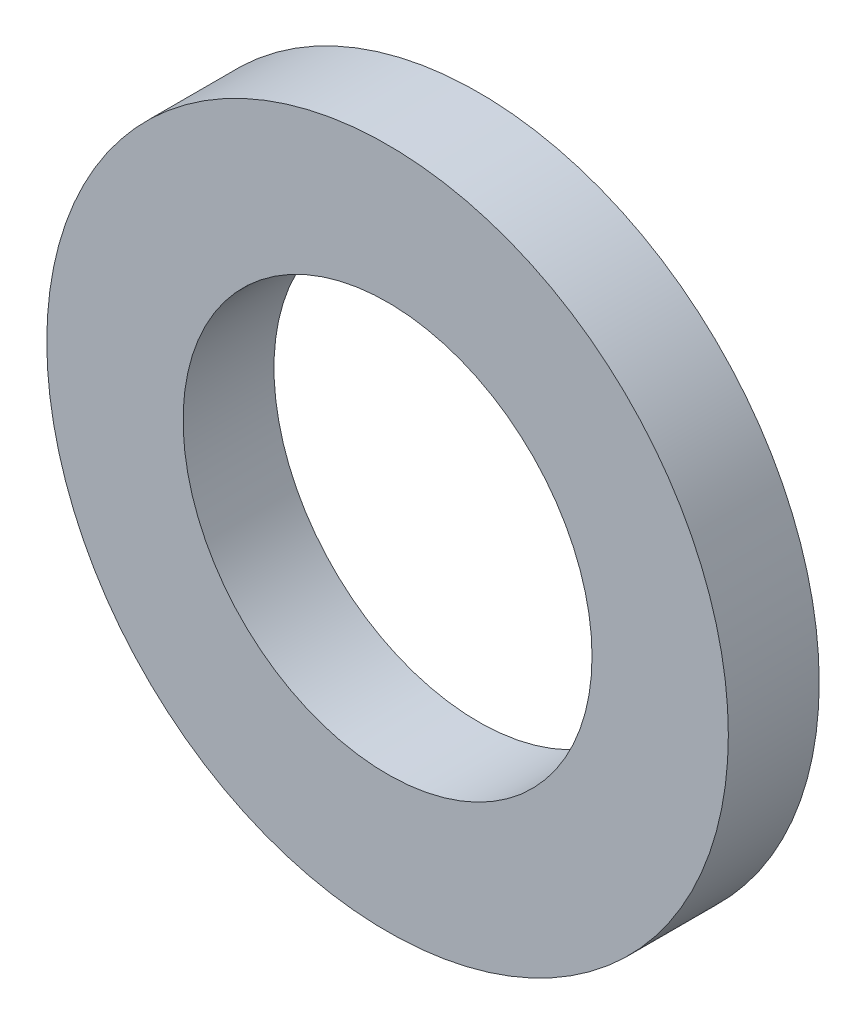
ISO-10303-21;
HEADER;
FILE_DESCRIPTION(('STEP AP214'),'2;1');
FILE_NAME('part.step','',(''),(''),'','','');
FILE_SCHEMA(('AUTOMOTIVE_DESIGN { 1 0 10303 214 1 1 1 1 }'));
ENDSEC;
DATA;
#1=APPLICATION_CONTEXT('core data for automotive mechanical design processes');
#2=APPLICATION_PROTOCOL_DEFINITION('international standard','automotive_design',2000,#1);
#3=PRODUCT_CONTEXT('',#1,'mechanical');
#4=PRODUCT('Part','Part','',(#3));
#5=PRODUCT_RELATED_PRODUCT_CATEGORY('part','',(#4));
#6=PRODUCT_DEFINITION_FORMATION('','',#4);
#7=PRODUCT_DEFINITION_CONTEXT('part definition',#1,'design');
#8=PRODUCT_DEFINITION('design','',#6,#7);
#9=PRODUCT_DEFINITION_SHAPE('','',#8);
#10=(LENGTH_UNIT() NAMED_UNIT(*) SI_UNIT(.MILLI.,.METRE.));
#11=(NAMED_UNIT(*) PLANE_ANGLE_UNIT() SI_UNIT($,.RADIAN.));
#12=(NAMED_UNIT(*) SI_UNIT($,.STERADIAN.) SOLID_ANGLE_UNIT());
#13=UNCERTAINTY_MEASURE_WITH_UNIT(LENGTH_MEASURE(1.E-05),#10,'distance_accuracy_value','');
#14=(GEOMETRIC_REPRESENTATION_CONTEXT(3) GLOBAL_UNCERTAINTY_ASSIGNED_CONTEXT((#13)) GLOBAL_UNIT_ASSIGNED_CONTEXT((#10,
#11,#12)) REPRESENTATION_CONTEXT('',''));
#15=CARTESIAN_POINT('',(0.,0.,0.));
#16=DIRECTION('',(0.,0.,1.));
#17=DIRECTION('',(1.,0.,0.));
#18=AXIS2_PLACEMENT_3D('',#15,#16,#17);
#19=CARTESIAN_POINT('',(0.,0.,2.));
#20=DIRECTION('',(0.,0.,1.));
#21=DIRECTION('',(1.,0.,0.));
#22=AXIS2_PLACEMENT_3D('',#19,#20,#21);
#23=PLANE('',#22);
#24=CARTESIAN_POINT('',(0.,0.,2.));
#25=DIRECTION('',(0.,0.,1.));
#26=DIRECTION('',(1.,0.,0.));
#27=AXIS2_PLACEMENT_3D('',#24,#25,#26);
#28=CIRCLE('',#27,7.5);
#29=CARTESIAN_POINT('',(7.5,0.,2.));
#30=VERTEX_POINT('',#29);
#31=EDGE_CURVE('E10',#30,#30,#28,.T.);
#32=ORIENTED_EDGE('',*,*,#31,.T.);
#33=EDGE_LOOP('',(#32));
#34=FACE_BOUND('',#33,.T.);
#35=CARTESIAN_POINT('',(0.,0.,2.));
#36=DIRECTION('',(0.,0.,1.));
#37=DIRECTION('',(1.,0.,0.));
#38=AXIS2_PLACEMENT_3D('',#35,#36,#37);
#39=CIRCLE('',#38,4.5);
#40=CARTESIAN_POINT('',(4.5,0.,2.));
#41=VERTEX_POINT('',#40);
#42=EDGE_CURVE('E42',#41,#41,#39,.T.);
#43=ORIENTED_EDGE('',*,*,#42,.F.);
#44=EDGE_LOOP('',(#43));
#45=FACE_BOUND('',#44,.T.);
#46=ADVANCED_FACE('F31',(#34,#45),#23,.T.);
#47=CARTESIAN_POINT('',(0.,0.,0.));
#48=DIRECTION('',(0.,0.,1.));
#49=DIRECTION('',(1.,0.,0.));
#50=AXIS2_PLACEMENT_3D('',#47,#48,#49);
#51=PLANE('',#50);
#52=CARTESIAN_POINT('',(0.,0.,0.));
#53=DIRECTION('',(0.,0.,1.));
#54=DIRECTION('',(1.,0.,0.));
#55=AXIS2_PLACEMENT_3D('',#52,#53,#54);
#56=CIRCLE('',#55,7.5);
#57=CARTESIAN_POINT('',(7.5,0.,0.));
#58=VERTEX_POINT('',#57);
#59=EDGE_CURVE('E35',#58,#58,#56,.T.);
#60=ORIENTED_EDGE('',*,*,#59,.F.);
#61=EDGE_LOOP('',(#60));
#62=FACE_BOUND('',#61,.T.);
#63=CARTESIAN_POINT('',(0.,0.,0.));
#64=DIRECTION('',(0.,0.,1.));
#65=DIRECTION('',(1.,0.,0.));
#66=AXIS2_PLACEMENT_3D('',#63,#64,#65);
#67=CIRCLE('',#66,4.5);
#68=CARTESIAN_POINT('',(4.5,0.,0.));
#69=VERTEX_POINT('',#68);
#70=EDGE_CURVE('E44',#69,#69,#67,.T.);
#71=ORIENTED_EDGE('',*,*,#70,.T.);
#72=EDGE_LOOP('',(#71));
#73=FACE_BOUND('',#72,.T.);
#74=ADVANCED_FACE('F54',(#62,#73),#51,.F.);
#75=CARTESIAN_POINT('',(0.,0.,2.));
#76=DIRECTION('',(0.,0.,-1.));
#77=DIRECTION('',(-1.,0.,0.));
#78=AXIS2_PLACEMENT_3D('',#75,#76,#77);
#79=CYLINDRICAL_SURFACE('',#78,7.5);
#80=ORIENTED_EDGE('',*,*,#31,.F.);
#81=EDGE_LOOP('',(#80));
#82=FACE_BOUND('',#81,.T.);
#83=ORIENTED_EDGE('',*,*,#59,.T.);
#84=EDGE_LOOP('',(#83));
#85=FACE_BOUND('',#84,.T.);
#86=ADVANCED_FACE('F33',(#82,#85),#79,.T.);
#87=CARTESIAN_POINT('',(0.,0.,2.));
#88=DIRECTION('',(0.,0.,-1.));
#89=DIRECTION('',(-1.,0.,0.));
#90=AXIS2_PLACEMENT_3D('',#87,#88,#89);
#91=CYLINDRICAL_SURFACE('',#90,4.5);
#92=ORIENTED_EDGE('',*,*,#42,.T.);
#93=EDGE_LOOP('',(#92));
#94=FACE_BOUND('',#93,.T.);
#95=ORIENTED_EDGE('',*,*,#70,.F.);
#96=EDGE_LOOP('',(#95));
#97=FACE_BOUND('',#96,.T.);
#98=ADVANCED_FACE('F50',(#94,#97),#91,.F.);
#99=CLOSED_SHELL('',(#46,#74,#86,#98));
#100=MANIFOLD_SOLID_BREP('B2',#99);
#101=ADVANCED_BREP_SHAPE_REPRESENTATION('',(#18,#100),#14);
#102=SHAPE_DEFINITION_REPRESENTATION(#9,#101);
ENDSEC;
END-ISO-10303-21;
